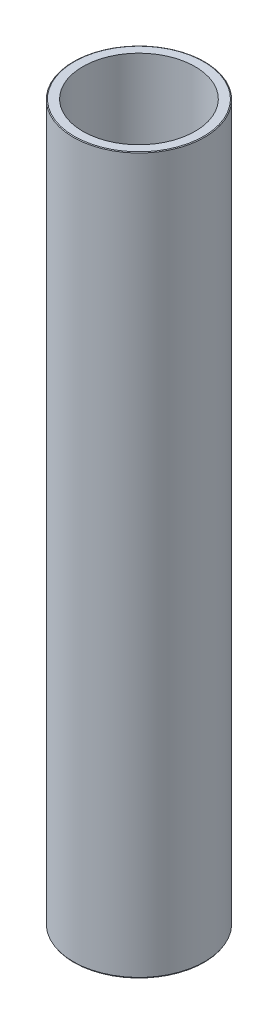
ISO-10303-21;
HEADER;
FILE_DESCRIPTION(('STEP AP214'),'2;1');
FILE_NAME('part.step','',(''),(''),'','','');
FILE_SCHEMA(('AUTOMOTIVE_DESIGN { 1 0 10303 214 1 1 1 1 }'));
ENDSEC;
DATA;
#1=APPLICATION_CONTEXT('core data for automotive mechanical design processes');
#2=APPLICATION_PROTOCOL_DEFINITION('international standard','automotive_design',2000,#1);
#3=PRODUCT_CONTEXT('',#1,'mechanical');
#4=PRODUCT('Part','Part','',(#3));
#5=PRODUCT_RELATED_PRODUCT_CATEGORY('part','',(#4));
#6=PRODUCT_DEFINITION_FORMATION('','',#4);
#7=PRODUCT_DEFINITION_CONTEXT('part definition',#1,'design');
#8=PRODUCT_DEFINITION('design','',#6,#7);
#9=PRODUCT_DEFINITION_SHAPE('','',#8);
#10=(LENGTH_UNIT() NAMED_UNIT(*) SI_UNIT(.MILLI.,.METRE.));
#11=(NAMED_UNIT(*) PLANE_ANGLE_UNIT() SI_UNIT($,.RADIAN.));
#12=(NAMED_UNIT(*) SI_UNIT($,.STERADIAN.) SOLID_ANGLE_UNIT());
#13=UNCERTAINTY_MEASURE_WITH_UNIT(LENGTH_MEASURE(1.E-05),#10,'distance_accuracy_value','');
#14=(GEOMETRIC_REPRESENTATION_CONTEXT(3) GLOBAL_UNCERTAINTY_ASSIGNED_CONTEXT((#13)) GLOBAL_UNIT_ASSIGNED_CONTEXT((#10,
#11,#12)) REPRESENTATION_CONTEXT('',''));
#15=CARTESIAN_POINT('',(0.,0.,0.));
#16=DIRECTION('',(0.,0.,1.));
#17=DIRECTION('',(1.,0.,0.));
#18=AXIS2_PLACEMENT_3D('',#15,#16,#17);
#19=CARTESIAN_POINT('',(0.,600.,0.));
#20=DIRECTION('',(0.,-1.,0.));
#21=DIRECTION('',(0.,0.,-1.));
#22=AXIS2_PLACEMENT_3D('',#19,#20,#21);
#23=CYLINDRICAL_SURFACE('',#22,55.);
#24=CARTESIAN_POINT('',(0.,599.585286254196,0.));
#25=DIRECTION('',(0.,1.,0.));
#26=DIRECTION('',(0.,0.,1.));
#27=AXIS2_PLACEMENT_3D('',#24,#25,#26);
#28=CIRCLE('',#27,55.);
#29=CARTESIAN_POINT('',(0.,599.585286254196,55.));
#30=VERTEX_POINT('',#29);
#31=EDGE_CURVE('E50',#30,#30,#28,.F.);
#32=ORIENTED_EDGE('',*,*,#31,.T.);
#33=EDGE_LOOP('',(#32));
#34=FACE_BOUND('',#33,.T.);
#35=CARTESIAN_POINT('',(0.,0.718305278330278,0.));
#36=DIRECTION('',(0.,1.,0.));
#37=DIRECTION('',(0.,0.,1.));
#38=AXIS2_PLACEMENT_3D('',#35,#36,#37);
#39=CIRCLE('',#38,55.);
#40=CARTESIAN_POINT('',(0.,0.718305278330278,55.));
#41=VERTEX_POINT('',#40);
#42=EDGE_CURVE('E51',#41,#41,#39,.T.);
#43=ORIENTED_EDGE('',*,*,#42,.T.);
#44=EDGE_LOOP('',(#43));
#45=FACE_BOUND('',#44,.T.);
#46=ADVANCED_FACE('F39',(#34,#45),#23,.T.);
#47=CARTESIAN_POINT('',(0.,600.,0.));
#48=DIRECTION('',(0.,1.,0.));
#49=DIRECTION('',(0.,0.,1.));
#50=AXIS2_PLACEMENT_3D('',#47,#48,#49);
#51=PLANE('',#50);
#52=CARTESIAN_POINT('',(0.,600.,0.));
#53=DIRECTION('',(0.,1.,0.));
#54=DIRECTION('',(0.,0.,1.));
#55=AXIS2_PLACEMENT_3D('',#52,#53,#54);
#56=CIRCLE('',#55,54.2816947216697);
#57=CARTESIAN_POINT('',(0.,600.,54.2816947216697));
#58=VERTEX_POINT('',#57);
#59=EDGE_CURVE('E54',#58,#58,#56,.T.);
#60=ORIENTED_EDGE('',*,*,#59,.T.);
#61=EDGE_LOOP('',(#60));
#62=FACE_BOUND('',#61,.T.);
#63=CARTESIAN_POINT('',(0.,600.,0.));
#64=DIRECTION('',(0.,1.,0.));
#65=DIRECTION('',(0.,0.,1.));
#66=AXIS2_PLACEMENT_3D('',#63,#64,#65);
#67=CIRCLE('',#66,47.0900168093812);
#68=CARTESIAN_POINT('',(0.,600.,47.0900168093812));
#69=VERTEX_POINT('',#68);
#70=EDGE_CURVE('E58',#69,#69,#67,.T.);
#71=ORIENTED_EDGE('',*,*,#70,.F.);
#72=EDGE_LOOP('',(#71));
#73=FACE_BOUND('',#72,.T.);
#74=ADVANCED_FACE('F69',(#62,#73),#51,.T.);
#75=CARTESIAN_POINT('',(0.,0.,0.));
#76=DIRECTION('',(0.,1.,0.));
#77=DIRECTION('',(0.,0.,1.));
#78=AXIS2_PLACEMENT_3D('',#75,#76,#77);
#79=PLANE('',#78);
#80=CARTESIAN_POINT('',(0.,0.,0.));
#81=DIRECTION('',(0.,1.,0.));
#82=DIRECTION('',(0.,0.,1.));
#83=AXIS2_PLACEMENT_3D('',#80,#81,#82);
#84=CIRCLE('',#83,54.5852862541957);
#85=CARTESIAN_POINT('',(0.,0.,54.5852862541957));
#86=VERTEX_POINT('',#85);
#87=EDGE_CURVE('E10',#86,#86,#84,.F.);
#88=ORIENTED_EDGE('',*,*,#87,.T.);
#89=EDGE_LOOP('',(#88));
#90=FACE_BOUND('',#89,.T.);
#91=CARTESIAN_POINT('',(0.,0.,0.));
#92=DIRECTION('',(0.,1.,0.));
#93=DIRECTION('',(0.,0.,1.));
#94=AXIS2_PLACEMENT_3D('',#91,#92,#93);
#95=CIRCLE('',#94,47.0900168093812);
#96=CARTESIAN_POINT('',(0.,0.,47.0900168093812));
#97=VERTEX_POINT('',#96);
#98=EDGE_CURVE('E63',#97,#97,#95,.T.);
#99=ORIENTED_EDGE('',*,*,#98,.T.);
#100=EDGE_LOOP('',(#99));
#101=FACE_BOUND('',#100,.T.);
#102=ADVANCED_FACE('F75',(#90,#101),#79,.F.);
#103=CARTESIAN_POINT('',(0.,600.,0.));
#104=DIRECTION('',(0.,-1.,0.));
#105=DIRECTION('',(0.,0.,-1.));
#106=AXIS2_PLACEMENT_3D('',#103,#104,#105);
#107=CYLINDRICAL_SURFACE('',#106,47.0900168093812);
#108=ORIENTED_EDGE('',*,*,#70,.T.);
#109=EDGE_LOOP('',(#108));
#110=FACE_BOUND('',#109,.T.);
#111=ORIENTED_EDGE('',*,*,#98,.F.);
#112=EDGE_LOOP('',(#111));
#113=FACE_BOUND('',#112,.T.);
#114=ADVANCED_FACE('F70',(#110,#113),#107,.F.);
#115=CARTESIAN_POINT('',(0.,600.,0.));
#116=DIRECTION('',(0.,-1.,0.));
#117=DIRECTION('',(0.,0.,-1.));
#118=AXIS2_PLACEMENT_3D('',#115,#116,#117);
#119=CONICAL_SURFACE('',#118,54.2816947216697,1.04719755119658);
#120=ORIENTED_EDGE('',*,*,#31,.F.);
#121=EDGE_LOOP('',(#120));
#122=FACE_BOUND('',#121,.T.);
#123=ORIENTED_EDGE('',*,*,#59,.F.);
#124=EDGE_LOOP('',(#123));
#125=FACE_BOUND('',#124,.T.);
#126=ADVANCED_FACE('F81',(#122,#125),#119,.T.);
#127=CARTESIAN_POINT('',(0.,0.718305278330278,0.));
#128=DIRECTION('',(0.,1.,0.));
#129=DIRECTION('',(0.,0.,1.));
#130=AXIS2_PLACEMENT_3D('',#127,#128,#129);
#131=CONICAL_SURFACE('',#130,55.,0.523598775598309);
#132=ORIENTED_EDGE('',*,*,#87,.F.);
#133=EDGE_LOOP('',(#132));
#134=FACE_BOUND('',#133,.T.);
#135=ORIENTED_EDGE('',*,*,#42,.F.);
#136=EDGE_LOOP('',(#135));
#137=FACE_BOUND('',#136,.T.);
#138=ADVANCED_FACE('F45',(#134,#137),#131,.T.);
#139=CLOSED_SHELL('',(#46,#74,#102,#114,#126,#138));
#140=MANIFOLD_SOLID_BREP('B2',#139);
#141=ADVANCED_BREP_SHAPE_REPRESENTATION('',(#18,#140),#14);
#142=SHAPE_DEFINITION_REPRESENTATION(#9,#141);
ENDSEC;
END-ISO-10303-21;
